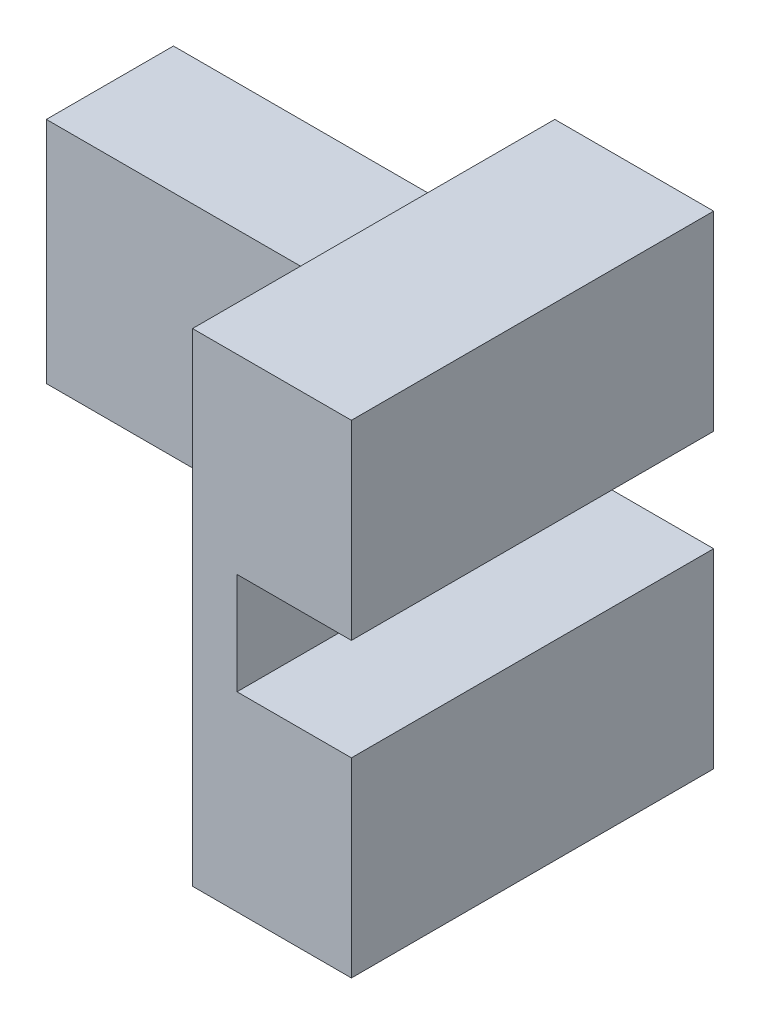
ISO-10303-21;
HEADER;
FILE_DESCRIPTION(('STEP AP214'),'2;1');
FILE_NAME('part.step','',(''),(''),'','','');
FILE_SCHEMA(('AUTOMOTIVE_DESIGN { 1 0 10303 214 1 1 1 1 }'));
ENDSEC;
DATA;
#1=APPLICATION_CONTEXT('core data for automotive mechanical design processes');
#2=APPLICATION_PROTOCOL_DEFINITION('international standard','automotive_design',2000,#1);
#3=PRODUCT_CONTEXT('',#1,'mechanical');
#4=PRODUCT('Part','Part','',(#3));
#5=PRODUCT_RELATED_PRODUCT_CATEGORY('part','',(#4));
#6=PRODUCT_DEFINITION_FORMATION('','',#4);
#7=PRODUCT_DEFINITION_CONTEXT('part definition',#1,'design');
#8=PRODUCT_DEFINITION('design','',#6,#7);
#9=PRODUCT_DEFINITION_SHAPE('','',#8);
#10=(LENGTH_UNIT() NAMED_UNIT(*) SI_UNIT(.MILLI.,.METRE.));
#11=(NAMED_UNIT(*) PLANE_ANGLE_UNIT() SI_UNIT($,.RADIAN.));
#12=(NAMED_UNIT(*) SI_UNIT($,.STERADIAN.) SOLID_ANGLE_UNIT());
#13=UNCERTAINTY_MEASURE_WITH_UNIT(LENGTH_MEASURE(1.E-05),#10,'distance_accuracy_value','');
#14=(GEOMETRIC_REPRESENTATION_CONTEXT(3) GLOBAL_UNCERTAINTY_ASSIGNED_CONTEXT((#13)) GLOBAL_UNIT_ASSIGNED_CONTEXT((#10,
#11,#12)) REPRESENTATION_CONTEXT('',''));
#15=CARTESIAN_POINT('',(0.,0.,0.));
#16=DIRECTION('',(0.,0.,1.));
#17=DIRECTION('',(1.,0.,0.));
#18=AXIS2_PLACEMENT_3D('',#15,#16,#17);
#19=CARTESIAN_POINT('',(-14.2593475554646,17.2489384560291,2.));
#20=DIRECTION('',(0.,1.,0.));
#21=DIRECTION('',(0.,0.,1.));
#22=AXIS2_PLACEMENT_3D('',#19,#20,#21);
#23=PLANE('',#22);
#24=DIRECTION('',(1.,0.,0.));
#25=VECTOR('',#24,1.);
#26=CARTESIAN_POINT('',(-14.2593475554646,17.2489384560291,0.));
#27=LINE('',#26,#25);
#28=CARTESIAN_POINT('',(-14.2593475554646,17.2489384560291,0.));
#29=VERTEX_POINT('',#28);
#30=CARTESIAN_POINT('',(-12.4593475554646,17.2489384560291,0.));
#31=VERTEX_POINT('',#30);
#32=EDGE_CURVE('E170',#29,#31,#27,.T.);
#33=ORIENTED_EDGE('',*,*,#32,.T.);
#34=DIRECTION('',(0.,0.,-1.));
#35=VECTOR('',#34,1.);
#36=CARTESIAN_POINT('',(-12.4593475554646,17.2489384560291,2.));
#37=LINE('',#36,#35);
#38=CARTESIAN_POINT('',(-12.4593475554646,17.2489384560291,5.7));
#39=VERTEX_POINT('',#38);
#40=EDGE_CURVE('E36',#39,#31,#37,.T.);
#41=ORIENTED_EDGE('',*,*,#40,.F.);
#42=DIRECTION('',(1.,0.,0.));
#43=VECTOR('',#42,1.);
#44=CARTESIAN_POINT('',(-12.4593475554646,17.2489384560291,5.7));
#45=LINE('',#44,#43);
#46=CARTESIAN_POINT('',(-14.2593475554646,17.2489384560291,5.7));
#47=VERTEX_POINT('',#46);
#48=EDGE_CURVE('E165',#47,#39,#45,.T.);
#49=ORIENTED_EDGE('',*,*,#48,.F.);
#50=DIRECTION('',(0.,0.,-1.));
#51=VECTOR('',#50,1.);
#52=CARTESIAN_POINT('',(-14.2593475554646,17.2489384560291,2.));
#53=LINE('',#52,#51);
#54=EDGE_CURVE('E177',#47,#29,#53,.T.);
#55=ORIENTED_EDGE('',*,*,#54,.T.);
#56=EDGE_LOOP('',(#33,#41,#49,#55));
#57=FACE_BOUND('',#56,.T.);
#58=ADVANCED_FACE('F33',(#57),#23,.F.);
#59=CARTESIAN_POINT('',(-12.4593475554646,17.2489384560291,2.));
#60=DIRECTION('',(-1.,0.,0.));
#61=DIRECTION('',(0.,-1.,0.));
#62=AXIS2_PLACEMENT_3D('',#59,#60,#61);
#63=PLANE('',#62);
#64=DIRECTION('',(0.,1.,0.));
#65=VECTOR('',#64,1.);
#66=CARTESIAN_POINT('',(-12.4593475554646,17.2489384560291,0.));
#67=LINE('',#66,#65);
#68=CARTESIAN_POINT('',(-12.4593475554646,20.2489384560291,0.));
#69=VERTEX_POINT('',#68);
#70=EDGE_CURVE('E180',#31,#69,#67,.T.);
#71=ORIENTED_EDGE('',*,*,#70,.T.);
#72=DIRECTION('',(0.,0.,-1.));
#73=VECTOR('',#72,1.);
#74=CARTESIAN_POINT('',(-12.4593475554646,20.2489384560291,2.));
#75=LINE('',#74,#73);
#76=CARTESIAN_POINT('',(-12.4593475554646,20.2489384560291,5.7));
#77=VERTEX_POINT('',#76);
#78=EDGE_CURVE('E216',#77,#69,#75,.T.);
#79=ORIENTED_EDGE('',*,*,#78,.F.);
#80=DIRECTION('',(0.,1.,0.));
#81=VECTOR('',#80,1.);
#82=CARTESIAN_POINT('',(-12.4593475554646,20.2489384560291,5.7));
#83=LINE('',#82,#81);
#84=EDGE_CURVE('E168',#39,#77,#83,.T.);
#85=ORIENTED_EDGE('',*,*,#84,.F.);
#86=ORIENTED_EDGE('',*,*,#40,.T.);
#87=EDGE_LOOP('',(#71,#79,#85,#86));
#88=FACE_BOUND('',#87,.T.);
#89=ADVANCED_FACE('F223',(#88),#63,.F.);
#90=CARTESIAN_POINT('',(-12.4593475554646,20.2489384560291,2.));
#91=DIRECTION('',(0.,-1.,0.));
#92=DIRECTION('',(0.,0.,-1.));
#93=AXIS2_PLACEMENT_3D('',#90,#91,#92);
#94=PLANE('',#93);
#95=DIRECTION('',(-1.,0.,0.));
#96=VECTOR('',#95,1.);
#97=CARTESIAN_POINT('',(-12.4593475554646,20.2489384560291,0.));
#98=LINE('',#97,#96);
#99=CARTESIAN_POINT('',(-14.9593475554646,20.2489384560291,0.));
#100=VERTEX_POINT('',#99);
#101=EDGE_CURVE('E182',#69,#100,#98,.T.);
#102=ORIENTED_EDGE('',*,*,#101,.T.);
#103=DIRECTION('',(0.,0.,-1.));
#104=VECTOR('',#103,1.);
#105=CARTESIAN_POINT('',(-14.9593475554646,20.2489384560291,2.));
#106=LINE('',#105,#104);
#107=CARTESIAN_POINT('',(-14.9593475554646,20.2489384560291,5.7));
#108=VERTEX_POINT('',#107);
#109=EDGE_CURVE('E215',#108,#100,#106,.T.);
#110=ORIENTED_EDGE('',*,*,#109,.F.);
#111=DIRECTION('',(-1.,0.,0.));
#112=VECTOR('',#111,1.);
#113=CARTESIAN_POINT('',(-14.9593475554646,20.2489384560291,5.7));
#114=LINE('',#113,#112);
#115=EDGE_CURVE('E155',#77,#108,#114,.T.);
#116=ORIENTED_EDGE('',*,*,#115,.F.);
#117=ORIENTED_EDGE('',*,*,#78,.T.);
#118=EDGE_LOOP('',(#102,#110,#116,#117));
#119=FACE_BOUND('',#118,.T.);
#120=ADVANCED_FACE('F231',(#119),#94,.F.);
#121=CARTESIAN_POINT('',(-14.9593475554646,18.2489384560291,2.));
#122=DIRECTION('',(0.,-1.,0.));
#123=DIRECTION('',(0.,0.,-1.));
#124=AXIS2_PLACEMENT_3D('',#121,#122,#123);
#125=PLANE('',#124);
#126=DIRECTION('',(-1.,0.,0.));
#127=VECTOR('',#126,1.);
#128=CARTESIAN_POINT('',(-14.9593475554646,18.2489384560291,0.));
#129=LINE('',#128,#127);
#130=CARTESIAN_POINT('',(-14.9593475554646,18.2489384560291,0.));
#131=VERTEX_POINT('',#130);
#132=CARTESIAN_POINT('',(-20.9593475554646,18.2489384560291,0.));
#133=VERTEX_POINT('',#132);
#134=EDGE_CURVE('E186',#131,#133,#129,.T.);
#135=ORIENTED_EDGE('',*,*,#134,.T.);
#136=DIRECTION('',(0.,0.,-1.));
#137=VECTOR('',#136,1.);
#138=CARTESIAN_POINT('',(-20.9593475554646,18.2489384560291,2.));
#139=LINE('',#138,#137);
#140=CARTESIAN_POINT('',(-20.9593475554646,18.2489384560291,2.));
#141=VERTEX_POINT('',#140);
#142=EDGE_CURVE('E209',#141,#133,#139,.T.);
#143=ORIENTED_EDGE('',*,*,#142,.F.);
#144=DIRECTION('',(-1.,0.,0.));
#145=VECTOR('',#144,1.);
#146=CARTESIAN_POINT('',(-14.9593475554646,18.2489384560291,2.));
#147=LINE('',#146,#145);
#148=CARTESIAN_POINT('',(-14.9593475554646,18.2489384560291,2.));
#149=VERTEX_POINT('',#148);
#150=EDGE_CURVE('E172',#149,#141,#147,.T.);
#151=ORIENTED_EDGE('',*,*,#150,.F.);
#152=DIRECTION('',(0.,0.,-1.));
#153=VECTOR('',#152,1.);
#154=CARTESIAN_POINT('',(-14.9593475554646,18.2489384560291,2.));
#155=LINE('',#154,#153);
#156=EDGE_CURVE('E212',#149,#131,#155,.T.);
#157=ORIENTED_EDGE('',*,*,#156,.T.);
#158=EDGE_LOOP('',(#135,#143,#151,#157));
#159=FACE_BOUND('',#158,.T.);
#160=ADVANCED_FACE('F234',(#159),#125,.F.);
#161=CARTESIAN_POINT('',(-20.9593475554646,18.2489384560291,2.));
#162=DIRECTION('',(1.,0.,0.));
#163=DIRECTION('',(0.,0.,-1.));
#164=AXIS2_PLACEMENT_3D('',#161,#162,#163);
#165=PLANE('',#164);
#166=DIRECTION('',(0.,-1.,0.));
#167=VECTOR('',#166,1.);
#168=CARTESIAN_POINT('',(-20.9593475554646,18.2489384560291,0.));
#169=LINE('',#168,#167);
#170=CARTESIAN_POINT('',(-20.9593475554646,14.6489384560291,0.));
#171=VERTEX_POINT('',#170);
#172=EDGE_CURVE('E188',#133,#171,#169,.T.);
#173=ORIENTED_EDGE('',*,*,#172,.T.);
#174=DIRECTION('',(0.,0.,-1.));
#175=VECTOR('',#174,1.);
#176=CARTESIAN_POINT('',(-20.9593475554646,14.6489384560291,2.));
#177=LINE('',#176,#175);
#178=CARTESIAN_POINT('',(-20.9593475554646,14.6489384560291,2.));
#179=VERTEX_POINT('',#178);
#180=EDGE_CURVE('E206',#179,#171,#177,.T.);
#181=ORIENTED_EDGE('',*,*,#180,.F.);
#182=DIRECTION('',(0.,-1.,0.));
#183=VECTOR('',#182,1.);
#184=CARTESIAN_POINT('',(-20.9593475554646,18.2489384560291,2.));
#185=LINE('',#184,#183);
#186=EDGE_CURVE('E174',#141,#179,#185,.T.);
#187=ORIENTED_EDGE('',*,*,#186,.F.);
#188=ORIENTED_EDGE('',*,*,#142,.T.);
#189=EDGE_LOOP('',(#173,#181,#187,#188));
#190=FACE_BOUND('',#189,.T.);
#191=ADVANCED_FACE('F240',(#190),#165,.F.);
#192=CARTESIAN_POINT('',(-14.9593475554646,14.6489384560291,2.));
#193=DIRECTION('',(0.,1.,0.));
#194=DIRECTION('',(0.,0.,1.));
#195=AXIS2_PLACEMENT_3D('',#192,#193,#194);
#196=PLANE('',#195);
#197=DIRECTION('',(1.,0.,0.));
#198=VECTOR('',#197,1.);
#199=CARTESIAN_POINT('',(-14.9593475554646,14.6489384560291,0.));
#200=LINE('',#199,#198);
#201=CARTESIAN_POINT('',(-14.9593475554646,14.6489384560291,0.));
#202=VERTEX_POINT('',#201);
#203=EDGE_CURVE('E190',#171,#202,#200,.T.);
#204=ORIENTED_EDGE('',*,*,#203,.T.);
#205=DIRECTION('',(0.,0.,-1.));
#206=VECTOR('',#205,1.);
#207=CARTESIAN_POINT('',(-14.9593475554646,14.6489384560291,2.));
#208=LINE('',#207,#206);
#209=CARTESIAN_POINT('',(-14.9593475554646,14.6489384560291,2.));
#210=VERTEX_POINT('',#209);
#211=EDGE_CURVE('E139',#210,#202,#208,.T.);
#212=ORIENTED_EDGE('',*,*,#211,.F.);
#213=DIRECTION('',(1.,0.,0.));
#214=VECTOR('',#213,1.);
#215=CARTESIAN_POINT('',(-14.9593475554646,14.6489384560291,2.));
#216=LINE('',#215,#214);
#217=EDGE_CURVE('E50',#179,#210,#216,.T.);
#218=ORIENTED_EDGE('',*,*,#217,.F.);
#219=ORIENTED_EDGE('',*,*,#180,.T.);
#220=EDGE_LOOP('',(#204,#212,#218,#219));
#221=FACE_BOUND('',#220,.T.);
#222=ADVANCED_FACE('F243',(#221),#196,.F.);
#223=CARTESIAN_POINT('',(-14.9593475554646,14.6489384560291,2.));
#224=DIRECTION('',(1.,0.,0.));
#225=DIRECTION('',(0.,0.,-1.));
#226=AXIS2_PLACEMENT_3D('',#223,#224,#225);
#227=PLANE('',#226);
#228=DIRECTION('',(0.,-1.,0.));
#229=VECTOR('',#228,1.);
#230=CARTESIAN_POINT('',(-14.9593475554646,14.6489384560291,0.));
#231=LINE('',#230,#229);
#232=CARTESIAN_POINT('',(-14.9593475554646,12.6489384560291,0.));
#233=VERTEX_POINT('',#232);
#234=EDGE_CURVE('E136',#202,#233,#231,.T.);
#235=ORIENTED_EDGE('',*,*,#234,.T.);
#236=DIRECTION('',(0.,0.,-1.));
#237=VECTOR('',#236,1.);
#238=CARTESIAN_POINT('',(-14.9593475554646,12.6489384560291,2.));
#239=LINE('',#238,#237);
#240=CARTESIAN_POINT('',(-14.9593475554646,12.6489384560291,5.7));
#241=VERTEX_POINT('',#240);
#242=EDGE_CURVE('E128',#241,#233,#239,.T.);
#243=ORIENTED_EDGE('',*,*,#242,.F.);
#244=DIRECTION('',(0.,-1.,0.));
#245=VECTOR('',#244,1.);
#246=CARTESIAN_POINT('',(-14.9593475554646,12.6489384560291,5.7));
#247=LINE('',#246,#245);
#248=EDGE_CURVE('E133',#108,#241,#247,.T.);
#249=ORIENTED_EDGE('',*,*,#248,.F.);
#250=ORIENTED_EDGE('',*,*,#109,.T.);
#251=DIRECTION('',(0.,-1.,0.));
#252=VECTOR('',#251,1.);
#253=CARTESIAN_POINT('',(-14.9593475554646,20.2489384560291,0.));
#254=LINE('',#253,#252);
#255=EDGE_CURVE('E184',#100,#131,#254,.T.);
#256=ORIENTED_EDGE('',*,*,#255,.T.);
#257=ORIENTED_EDGE('',*,*,#156,.F.);
#258=DIRECTION('',(0.,-1.,0.));
#259=VECTOR('',#258,1.);
#260=CARTESIAN_POINT('',(-14.9593475554646,12.6489384560291,2.));
#261=LINE('',#260,#259);
#262=EDGE_CURVE('E11',#149,#210,#261,.T.);
#263=ORIENTED_EDGE('',*,*,#262,.T.);
#264=ORIENTED_EDGE('',*,*,#211,.T.);
#265=EDGE_LOOP('',(#235,#243,#249,#250,#256,#257,#263,#264));
#266=FACE_BOUND('',#265,.T.);
#267=ADVANCED_FACE('F130',(#266),#227,.F.);
#268=CARTESIAN_POINT('',(-12.4593475554646,12.6489384560291,2.));
#269=DIRECTION('',(0.,1.,0.));
#270=DIRECTION('',(0.,0.,1.));
#271=AXIS2_PLACEMENT_3D('',#268,#269,#270);
#272=PLANE('',#271);
#273=DIRECTION('',(1.,0.,0.));
#274=VECTOR('',#273,1.);
#275=CARTESIAN_POINT('',(-12.4593475554646,12.6489384560291,0.));
#276=LINE('',#275,#274);
#277=CARTESIAN_POINT('',(-12.4593475554646,12.6489384560291,0.));
#278=VERTEX_POINT('',#277);
#279=EDGE_CURVE('E193',#233,#278,#276,.T.);
#280=ORIENTED_EDGE('',*,*,#279,.T.);
#281=DIRECTION('',(0.,0.,-1.));
#282=VECTOR('',#281,1.);
#283=CARTESIAN_POINT('',(-12.4593475554646,12.6489384560291,2.));
#284=LINE('',#283,#282);
#285=CARTESIAN_POINT('',(-12.4593475554646,12.6489384560291,5.7));
#286=VERTEX_POINT('',#285);
#287=EDGE_CURVE('E140',#286,#278,#284,.T.);
#288=ORIENTED_EDGE('',*,*,#287,.F.);
#289=DIRECTION('',(1.,0.,0.));
#290=VECTOR('',#289,1.);
#291=CARTESIAN_POINT('',(-12.4593475554646,12.6489384560291,5.7));
#292=LINE('',#291,#290);
#293=EDGE_CURVE('E143',#241,#286,#292,.T.);
#294=ORIENTED_EDGE('',*,*,#293,.F.);
#295=ORIENTED_EDGE('',*,*,#242,.T.);
#296=EDGE_LOOP('',(#280,#288,#294,#295));
#297=FACE_BOUND('',#296,.T.);
#298=ADVANCED_FACE('F144',(#297),#272,.F.);
#299=CARTESIAN_POINT('',(-12.4593475554646,15.6489384560291,2.));
#300=DIRECTION('',(-1.,0.,0.));
#301=DIRECTION('',(0.,-1.,0.));
#302=AXIS2_PLACEMENT_3D('',#299,#300,#301);
#303=PLANE('',#302);
#304=DIRECTION('',(0.,1.,0.));
#305=VECTOR('',#304,1.);
#306=CARTESIAN_POINT('',(-12.4593475554646,15.6489384560291,0.));
#307=LINE('',#306,#305);
#308=CARTESIAN_POINT('',(-12.4593475554646,15.6489384560291,0.));
#309=VERTEX_POINT('',#308);
#310=EDGE_CURVE('E195',#278,#309,#307,.T.);
#311=ORIENTED_EDGE('',*,*,#310,.T.);
#312=DIRECTION('',(0.,0.,-1.));
#313=VECTOR('',#312,1.);
#314=CARTESIAN_POINT('',(-12.4593475554646,15.6489384560291,2.));
#315=LINE('',#314,#313);
#316=CARTESIAN_POINT('',(-12.4593475554646,15.6489384560291,5.7));
#317=VERTEX_POINT('',#316);
#318=EDGE_CURVE('E202',#317,#309,#315,.T.);
#319=ORIENTED_EDGE('',*,*,#318,.F.);
#320=DIRECTION('',(0.,1.,0.));
#321=VECTOR('',#320,1.);
#322=CARTESIAN_POINT('',(-12.4593475554646,15.6489384560291,5.7));
#323=LINE('',#322,#321);
#324=EDGE_CURVE('E149',#286,#317,#323,.T.);
#325=ORIENTED_EDGE('',*,*,#324,.F.);
#326=ORIENTED_EDGE('',*,*,#287,.T.);
#327=EDGE_LOOP('',(#311,#319,#325,#326));
#328=FACE_BOUND('',#327,.T.);
#329=ADVANCED_FACE('F246',(#328),#303,.F.);
#330=CARTESIAN_POINT('',(-14.2593475554646,15.6489384560291,2.));
#331=DIRECTION('',(0.,-1.,0.));
#332=DIRECTION('',(0.,0.,-1.));
#333=AXIS2_PLACEMENT_3D('',#330,#331,#332);
#334=PLANE('',#333);
#335=DIRECTION('',(-1.,0.,0.));
#336=VECTOR('',#335,1.);
#337=CARTESIAN_POINT('',(-14.2593475554646,15.6489384560291,0.));
#338=LINE('',#337,#336);
#339=CARTESIAN_POINT('',(-14.2593475554646,15.6489384560291,0.));
#340=VERTEX_POINT('',#339);
#341=EDGE_CURVE('E92',#309,#340,#338,.T.);
#342=ORIENTED_EDGE('',*,*,#341,.T.);
#343=DIRECTION('',(0.,0.,-1.));
#344=VECTOR('',#343,1.);
#345=CARTESIAN_POINT('',(-14.2593475554646,15.6489384560291,2.));
#346=LINE('',#345,#344);
#347=CARTESIAN_POINT('',(-14.2593475554646,15.6489384560291,5.7));
#348=VERTEX_POINT('',#347);
#349=EDGE_CURVE('E200',#348,#340,#346,.T.);
#350=ORIENTED_EDGE('',*,*,#349,.F.);
#351=DIRECTION('',(-1.,0.,0.));
#352=VECTOR('',#351,1.);
#353=CARTESIAN_POINT('',(-14.2593475554646,15.6489384560291,5.7));
#354=LINE('',#353,#352);
#355=EDGE_CURVE('E159',#317,#348,#354,.T.);
#356=ORIENTED_EDGE('',*,*,#355,.F.);
#357=ORIENTED_EDGE('',*,*,#318,.T.);
#358=EDGE_LOOP('',(#342,#350,#356,#357));
#359=FACE_BOUND('',#358,.T.);
#360=ADVANCED_FACE('F249',(#359),#334,.F.);
#361=CARTESIAN_POINT('',(-14.2593475554646,17.2489384560291,2.));
#362=DIRECTION('',(-1.,0.,0.));
#363=DIRECTION('',(0.,-1.,0.));
#364=AXIS2_PLACEMENT_3D('',#361,#362,#363);
#365=PLANE('',#364);
#366=DIRECTION('',(0.,1.,0.));
#367=VECTOR('',#366,1.);
#368=CARTESIAN_POINT('',(-14.2593475554646,17.2489384560291,0.));
#369=LINE('',#368,#367);
#370=EDGE_CURVE('E99',#340,#29,#369,.T.);
#371=ORIENTED_EDGE('',*,*,#370,.T.);
#372=ORIENTED_EDGE('',*,*,#54,.F.);
#373=DIRECTION('',(0.,1.,0.));
#374=VECTOR('',#373,1.);
#375=CARTESIAN_POINT('',(-14.2593475554646,17.2489384560291,5.7));
#376=LINE('',#375,#374);
#377=EDGE_CURVE('E162',#348,#47,#376,.T.);
#378=ORIENTED_EDGE('',*,*,#377,.F.);
#379=ORIENTED_EDGE('',*,*,#349,.T.);
#380=EDGE_LOOP('',(#371,#372,#378,#379));
#381=FACE_BOUND('',#380,.T.);
#382=ADVANCED_FACE('F250',(#381),#365,.F.);
#383=CARTESIAN_POINT('',(0.,0.,2.));
#384=DIRECTION('',(0.,0.,1.));
#385=DIRECTION('',(1.,0.,0.));
#386=AXIS2_PLACEMENT_3D('',#383,#384,#385);
#387=PLANE('',#386);
#388=ORIENTED_EDGE('',*,*,#262,.F.);
#389=ORIENTED_EDGE('',*,*,#150,.T.);
#390=ORIENTED_EDGE('',*,*,#186,.T.);
#391=ORIENTED_EDGE('',*,*,#217,.T.);
#392=EDGE_LOOP('',(#388,#389,#390,#391));
#393=FACE_BOUND('',#392,.T.);
#394=ADVANCED_FACE('F252',(#393),#387,.T.);
#395=CARTESIAN_POINT('',(0.,0.,0.));
#396=DIRECTION('',(0.,0.,1.));
#397=DIRECTION('',(1.,0.,0.));
#398=AXIS2_PLACEMENT_3D('',#395,#396,#397);
#399=PLANE('',#398);
#400=ORIENTED_EDGE('',*,*,#32,.F.);
#401=ORIENTED_EDGE('',*,*,#370,.F.);
#402=ORIENTED_EDGE('',*,*,#341,.F.);
#403=ORIENTED_EDGE('',*,*,#310,.F.);
#404=ORIENTED_EDGE('',*,*,#279,.F.);
#405=ORIENTED_EDGE('',*,*,#234,.F.);
#406=ORIENTED_EDGE('',*,*,#203,.F.);
#407=ORIENTED_EDGE('',*,*,#172,.F.);
#408=ORIENTED_EDGE('',*,*,#134,.F.);
#409=ORIENTED_EDGE('',*,*,#255,.F.);
#410=ORIENTED_EDGE('',*,*,#101,.F.);
#411=ORIENTED_EDGE('',*,*,#70,.F.);
#412=EDGE_LOOP('',(#400,#401,#402,#403,#404,#405,#406,#407,#408,#409,#410,#411));
#413=FACE_BOUND('',#412,.T.);
#414=ADVANCED_FACE('F228',(#413),#399,.F.);
#415=CARTESIAN_POINT('',(0.,0.,5.7));
#416=DIRECTION('',(0.,0.,-1.));
#417=DIRECTION('',(-1.,0.,0.));
#418=AXIS2_PLACEMENT_3D('',#415,#416,#417);
#419=PLANE('',#418);
#420=ORIENTED_EDGE('',*,*,#248,.T.);
#421=ORIENTED_EDGE('',*,*,#293,.T.);
#422=ORIENTED_EDGE('',*,*,#324,.T.);
#423=ORIENTED_EDGE('',*,*,#355,.T.);
#424=ORIENTED_EDGE('',*,*,#377,.T.);
#425=ORIENTED_EDGE('',*,*,#48,.T.);
#426=ORIENTED_EDGE('',*,*,#84,.T.);
#427=ORIENTED_EDGE('',*,*,#115,.T.);
#428=EDGE_LOOP('',(#420,#421,#422,#423,#424,#425,#426,#427));
#429=FACE_BOUND('',#428,.T.);
#430=ADVANCED_FACE('F152',(#429),#419,.F.);
#431=CLOSED_SHELL('',(#58,#89,#120,#160,#191,#222,#267,#298,#329,#360,#382,#394,#414,#430));
#432=MANIFOLD_SOLID_BREP('B2',#431);
#433=ADVANCED_BREP_SHAPE_REPRESENTATION('',(#18,#432),#14);
#434=SHAPE_DEFINITION_REPRESENTATION(#9,#433);
ENDSEC;
END-ISO-10303-21;
